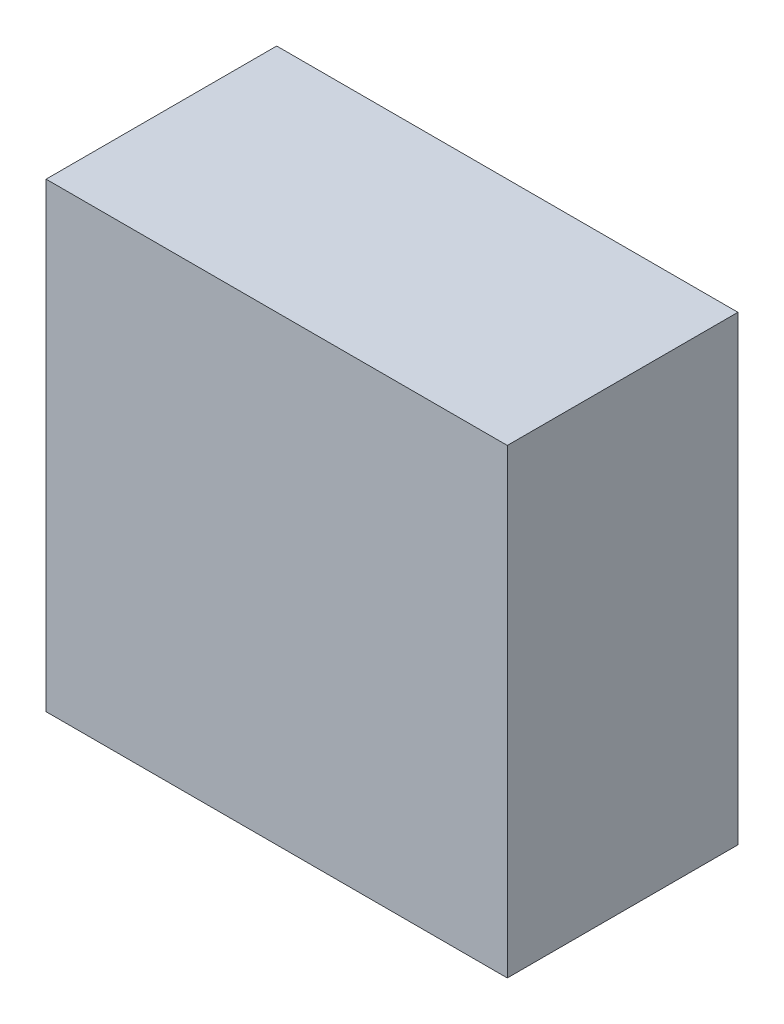
ISO-10303-21;
HEADER;
FILE_DESCRIPTION(('STEP AP214'),'2;1');
FILE_NAME('part.step','',(''),(''),'','','');
FILE_SCHEMA(('AUTOMOTIVE_DESIGN { 1 0 10303 214 1 1 1 1 }'));
ENDSEC;
DATA;
#1=APPLICATION_CONTEXT('core data for automotive mechanical design processes');
#2=APPLICATION_PROTOCOL_DEFINITION('international standard','automotive_design',2000,#1);
#3=PRODUCT_CONTEXT('',#1,'mechanical');
#4=PRODUCT('Part','Part','',(#3));
#5=PRODUCT_RELATED_PRODUCT_CATEGORY('part','',(#4));
#6=PRODUCT_DEFINITION_FORMATION('','',#4);
#7=PRODUCT_DEFINITION_CONTEXT('part definition',#1,'design');
#8=PRODUCT_DEFINITION('design','',#6,#7);
#9=PRODUCT_DEFINITION_SHAPE('','',#8);
#10=(LENGTH_UNIT() NAMED_UNIT(*) SI_UNIT(.MILLI.,.METRE.));
#11=(NAMED_UNIT(*) PLANE_ANGLE_UNIT() SI_UNIT($,.RADIAN.));
#12=(NAMED_UNIT(*) SI_UNIT($,.STERADIAN.) SOLID_ANGLE_UNIT());
#13=UNCERTAINTY_MEASURE_WITH_UNIT(LENGTH_MEASURE(1.E-05),#10,'distance_accuracy_value','');
#14=(GEOMETRIC_REPRESENTATION_CONTEXT(3) GLOBAL_UNCERTAINTY_ASSIGNED_CONTEXT((#13)) GLOBAL_UNIT_ASSIGNED_CONTEXT((#10,
#11,#12)) REPRESENTATION_CONTEXT('',''));
#15=CARTESIAN_POINT('',(0.,0.,0.));
#16=DIRECTION('',(0.,0.,1.));
#17=DIRECTION('',(1.,0.,0.));
#18=AXIS2_PLACEMENT_3D('',#15,#16,#17);
#19=CARTESIAN_POINT('',(0.,0.,2.75));
#20=DIRECTION('',(0.,0.,-1.));
#21=DIRECTION('',(-1.,0.,0.));
#22=AXIS2_PLACEMENT_3D('',#19,#20,#21);
#23=PLANE('',#22);
#24=DIRECTION('',(1.,0.,0.));
#25=VECTOR('',#24,1.);
#26=CARTESIAN_POINT('',(62.0000000000001,165.941489418563,2.75));
#27=LINE('',#26,#25);
#28=CARTESIAN_POINT('',(58.0000000000001,165.941489418563,2.75));
#29=VERTEX_POINT('',#28);
#30=CARTESIAN_POINT('',(62.0000000000001,165.941489418563,2.75));
#31=VERTEX_POINT('',#30);
#32=EDGE_CURVE('E80',#29,#31,#27,.T.);
#33=ORIENTED_EDGE('',*,*,#32,.T.);
#34=DIRECTION('',(0.,1.,0.));
#35=VECTOR('',#34,1.);
#36=CARTESIAN_POINT('',(62.0000000000001,169.941489418563,2.75));
#37=LINE('',#36,#35);
#38=CARTESIAN_POINT('',(62.0000000000001,169.941489418563,2.75));
#39=VERTEX_POINT('',#38);
#40=EDGE_CURVE('E55',#31,#39,#37,.T.);
#41=ORIENTED_EDGE('',*,*,#40,.T.);
#42=DIRECTION('',(1.,0.,0.));
#43=VECTOR('',#42,1.);
#44=CARTESIAN_POINT('',(62.0000000000001,169.941489418563,2.75));
#45=LINE('',#44,#43);
#46=CARTESIAN_POINT('',(58.0000000000001,169.941489418563,2.75));
#47=VERTEX_POINT('',#46);
#48=EDGE_CURVE('E57',#39,#47,#45,.F.);
#49=ORIENTED_EDGE('',*,*,#48,.T.);
#50=DIRECTION('',(0.,1.,0.));
#51=VECTOR('',#50,1.);
#52=CARTESIAN_POINT('',(58.0000000000001,169.941489418563,2.75));
#53=LINE('',#52,#51);
#54=EDGE_CURVE('E20',#47,#29,#53,.F.);
#55=ORIENTED_EDGE('',*,*,#54,.T.);
#56=EDGE_LOOP('',(#33,#41,#49,#55));
#57=FACE_BOUND('',#56,.T.);
#58=ADVANCED_FACE('F17',(#57),#23,.F.);
#59=CARTESIAN_POINT('',(58.0000000000001,169.941489418563,2.75));
#60=DIRECTION('',(1.,0.,0.));
#61=DIRECTION('',(0.,0.,-1.));
#62=AXIS2_PLACEMENT_3D('',#59,#60,#61);
#63=PLANE('',#62);
#64=DIRECTION('',(0.,0.,1.));
#65=VECTOR('',#64,1.);
#66=CARTESIAN_POINT('',(58.0000000000001,165.941489418563,2.75));
#67=LINE('',#66,#65);
#68=CARTESIAN_POINT('',(58.0000000000001,165.941489418563,0.75));
#69=VERTEX_POINT('',#68);
#70=EDGE_CURVE('E68',#69,#29,#67,.T.);
#71=ORIENTED_EDGE('',*,*,#70,.T.);
#72=ORIENTED_EDGE('',*,*,#54,.F.);
#73=DIRECTION('',(0.,0.,-1.));
#74=VECTOR('',#73,1.);
#75=CARTESIAN_POINT('',(58.0000000000001,169.941489418563,2.75));
#76=LINE('',#75,#74);
#77=CARTESIAN_POINT('',(58.0000000000001,169.941489418563,0.75));
#78=VERTEX_POINT('',#77);
#79=EDGE_CURVE('E63',#47,#78,#76,.T.);
#80=ORIENTED_EDGE('',*,*,#79,.T.);
#81=DIRECTION('',(0.,1.,0.));
#82=VECTOR('',#81,1.);
#83=CARTESIAN_POINT('',(58.0000000000001,0.,0.75));
#84=LINE('',#83,#82);
#85=EDGE_CURVE('E83',#69,#78,#84,.T.);
#86=ORIENTED_EDGE('',*,*,#85,.F.);
#87=EDGE_LOOP('',(#71,#72,#80,#86));
#88=FACE_BOUND('',#87,.T.);
#89=ADVANCED_FACE('F65',(#88),#63,.F.);
#90=CARTESIAN_POINT('',(62.0000000000001,169.941489418563,2.75));
#91=DIRECTION('',(0.,-1.,0.));
#92=DIRECTION('',(0.,0.,-1.));
#93=AXIS2_PLACEMENT_3D('',#90,#91,#92);
#94=PLANE('',#93);
#95=ORIENTED_EDGE('',*,*,#79,.F.);
#96=ORIENTED_EDGE('',*,*,#48,.F.);
#97=DIRECTION('',(0.,0.,1.));
#98=VECTOR('',#97,1.);
#99=CARTESIAN_POINT('',(62.0000000000001,169.941489418563,2.75));
#100=LINE('',#99,#98);
#101=CARTESIAN_POINT('',(62.0000000000001,169.941489418563,0.75));
#102=VERTEX_POINT('',#101);
#103=EDGE_CURVE('E75',#39,#102,#100,.F.);
#104=ORIENTED_EDGE('',*,*,#103,.T.);
#105=DIRECTION('',(-1.,0.,0.));
#106=VECTOR('',#105,1.);
#107=CARTESIAN_POINT('',(0.,169.941489418563,0.75));
#108=LINE('',#107,#106);
#109=EDGE_CURVE('E72',#78,#102,#108,.F.);
#110=ORIENTED_EDGE('',*,*,#109,.F.);
#111=EDGE_LOOP('',(#95,#96,#104,#110));
#112=FACE_BOUND('',#111,.T.);
#113=ADVANCED_FACE('F70',(#112),#94,.F.);
#114=CARTESIAN_POINT('',(62.0000000000001,169.941489418563,2.75));
#115=DIRECTION('',(-1.,0.,0.));
#116=DIRECTION('',(0.,0.,1.));
#117=AXIS2_PLACEMENT_3D('',#114,#115,#116);
#118=PLANE('',#117);
#119=ORIENTED_EDGE('',*,*,#103,.F.);
#120=ORIENTED_EDGE('',*,*,#40,.F.);
#121=DIRECTION('',(0.,0.,1.));
#122=VECTOR('',#121,1.);
#123=CARTESIAN_POINT('',(62.0000000000001,165.941489418563,2.75));
#124=LINE('',#123,#122);
#125=CARTESIAN_POINT('',(62.0000000000001,165.941489418563,0.75));
#126=VERTEX_POINT('',#125);
#127=EDGE_CURVE('E35',#31,#126,#124,.F.);
#128=ORIENTED_EDGE('',*,*,#127,.T.);
#129=DIRECTION('',(0.,1.,0.));
#130=VECTOR('',#129,1.);
#131=CARTESIAN_POINT('',(62.0000000000001,0.,0.75));
#132=LINE('',#131,#130);
#133=EDGE_CURVE('E26',#102,#126,#132,.F.);
#134=ORIENTED_EDGE('',*,*,#133,.F.);
#135=EDGE_LOOP('',(#119,#120,#128,#134));
#136=FACE_BOUND('',#135,.T.);
#137=ADVANCED_FACE('F89',(#136),#118,.F.);
#138=CARTESIAN_POINT('',(62.0000000000001,165.941489418563,2.75));
#139=DIRECTION('',(0.,1.,0.));
#140=DIRECTION('',(0.,0.,1.));
#141=AXIS2_PLACEMENT_3D('',#138,#139,#140);
#142=PLANE('',#141);
#143=ORIENTED_EDGE('',*,*,#127,.F.);
#144=ORIENTED_EDGE('',*,*,#32,.F.);
#145=ORIENTED_EDGE('',*,*,#70,.F.);
#146=DIRECTION('',(-1.,0.,0.));
#147=VECTOR('',#146,1.);
#148=CARTESIAN_POINT('',(0.,165.941489418563,0.75));
#149=LINE('',#148,#147);
#150=EDGE_CURVE('E11',#126,#69,#149,.T.);
#151=ORIENTED_EDGE('',*,*,#150,.F.);
#152=EDGE_LOOP('',(#143,#144,#145,#151));
#153=FACE_BOUND('',#152,.T.);
#154=ADVANCED_FACE('F91',(#153),#142,.F.);
#155=CARTESIAN_POINT('',(0.,0.,0.75));
#156=DIRECTION('',(0.,0.,-1.));
#157=DIRECTION('',(-1.,0.,0.));
#158=AXIS2_PLACEMENT_3D('',#155,#156,#157);
#159=PLANE('',#158);
#160=ORIENTED_EDGE('',*,*,#133,.T.);
#161=ORIENTED_EDGE('',*,*,#150,.T.);
#162=ORIENTED_EDGE('',*,*,#85,.T.);
#163=ORIENTED_EDGE('',*,*,#109,.T.);
#164=EDGE_LOOP('',(#160,#161,#162,#163));
#165=FACE_BOUND('',#164,.T.);
#166=ADVANCED_FACE('F88',(#165),#159,.T.);
#167=CLOSED_SHELL('',(#58,#89,#113,#137,#154,#166));
#168=MANIFOLD_SOLID_BREP('B1',#167);
#169=ADVANCED_BREP_SHAPE_REPRESENTATION('',(#18,#168),#14);
#170=SHAPE_DEFINITION_REPRESENTATION(#9,#169);
ENDSEC;
END-ISO-10303-21;
